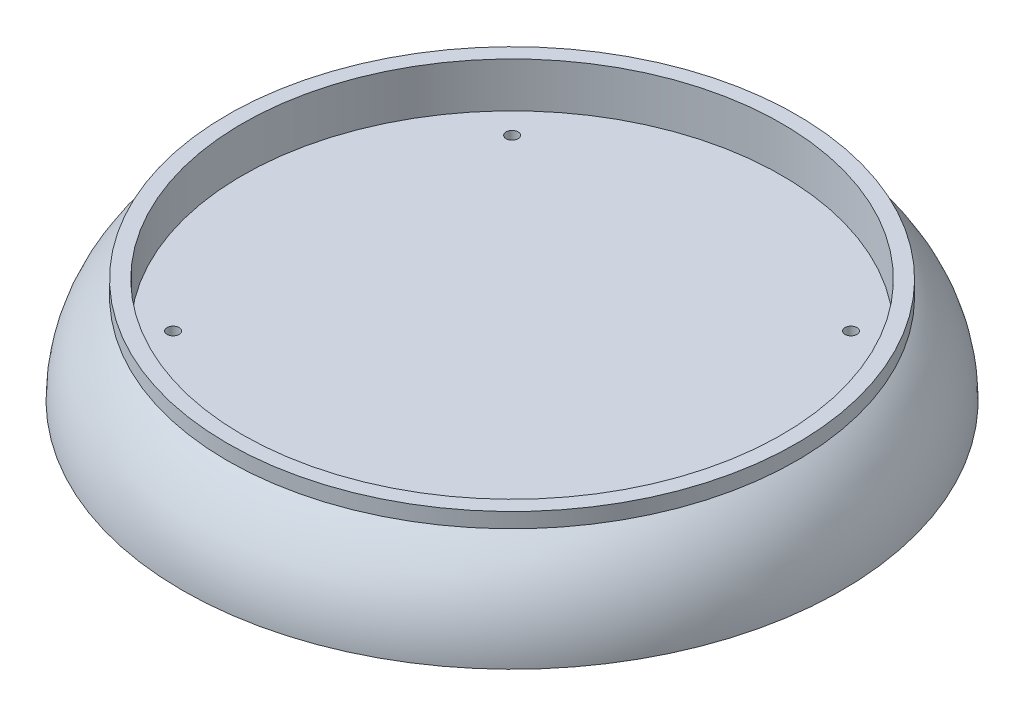
ISO-10303-21;
HEADER;
FILE_DESCRIPTION(('STEP AP214'),'2;1');
FILE_NAME('part.step','',(''),(''),'','','');
FILE_SCHEMA(('AUTOMOTIVE_DESIGN { 1 0 10303 214 1 1 1 1 }'));
ENDSEC;
DATA;
#1=APPLICATION_CONTEXT('core data for automotive mechanical design processes');
#2=APPLICATION_PROTOCOL_DEFINITION('international standard','automotive_design',2000,#1);
#3=PRODUCT_CONTEXT('',#1,'mechanical');
#4=PRODUCT('Part','Part','',(#3));
#5=PRODUCT_RELATED_PRODUCT_CATEGORY('part','',(#4));
#6=PRODUCT_DEFINITION_FORMATION('','',#4);
#7=PRODUCT_DEFINITION_CONTEXT('part definition',#1,'design');
#8=PRODUCT_DEFINITION('design','',#6,#7);
#9=PRODUCT_DEFINITION_SHAPE('','',#8);
#10=(LENGTH_UNIT() NAMED_UNIT(*) SI_UNIT(.MILLI.,.METRE.));
#11=(NAMED_UNIT(*) PLANE_ANGLE_UNIT() SI_UNIT($,.RADIAN.));
#12=(NAMED_UNIT(*) SI_UNIT($,.STERADIAN.) SOLID_ANGLE_UNIT());
#13=UNCERTAINTY_MEASURE_WITH_UNIT(LENGTH_MEASURE(1.E-05),#10,'distance_accuracy_value','');
#14=(GEOMETRIC_REPRESENTATION_CONTEXT(3) GLOBAL_UNCERTAINTY_ASSIGNED_CONTEXT((#13)) GLOBAL_UNIT_ASSIGNED_CONTEXT((#10,
#11,#12)) REPRESENTATION_CONTEXT('',''));
#15=CARTESIAN_POINT('',(0.,0.,0.));
#16=DIRECTION('',(0.,0.,1.));
#17=DIRECTION('',(1.,0.,0.));
#18=AXIS2_PLACEMENT_3D('',#15,#16,#17);
#19=CARTESIAN_POINT('',(0.,0.,0.));
#20=DIRECTION('',(0.,-1.,0.));
#21=DIRECTION('',(0.,0.,-1.));
#22=AXIS2_PLACEMENT_3D('',#19,#20,#21);
#23=PLANE('',#22);
#24=CARTESIAN_POINT('',(56.5685424949238,0.,56.5685424949238));
#25=DIRECTION('',(0.,1.,0.));
#26=DIRECTION('',(0.,0.,1.));
#27=AXIS2_PLACEMENT_3D('',#24,#25,#26);
#28=CIRCLE('',#27,2.);
#29=CARTESIAN_POINT('',(56.5685424949238,0.,58.5685424949238));
#30=VERTEX_POINT('',#29);
#31=EDGE_CURVE('E71',#30,#30,#28,.T.);
#32=ORIENTED_EDGE('',*,*,#31,.F.);
#33=EDGE_LOOP('',(#32));
#34=FACE_BOUND('',#33,.T.);
#35=CARTESIAN_POINT('',(56.5685424949238,0.,-56.5685424949238));
#36=DIRECTION('',(0.,1.,0.));
#37=DIRECTION('',(0.,0.,-1.));
#38=AXIS2_PLACEMENT_3D('',#35,#36,#37);
#39=CIRCLE('',#38,2.);
#40=CARTESIAN_POINT('',(56.5685424949238,0.,-58.5685424949238));
#41=VERTEX_POINT('',#40);
#42=EDGE_CURVE('E65',#41,#41,#39,.T.);
#43=ORIENTED_EDGE('',*,*,#42,.F.);
#44=EDGE_LOOP('',(#43));
#45=FACE_BOUND('',#44,.T.);
#46=CARTESIAN_POINT('',(-56.5685424949238,0.,56.5685424949238));
#47=DIRECTION('',(0.,1.,0.));
#48=DIRECTION('',(0.,0.,-1.));
#49=AXIS2_PLACEMENT_3D('',#46,#47,#48);
#50=CIRCLE('',#49,2.);
#51=CARTESIAN_POINT('',(-56.5685424949238,0.,54.5685424949238));
#52=VERTEX_POINT('',#51);
#53=EDGE_CURVE('E59',#52,#52,#50,.T.);
#54=ORIENTED_EDGE('',*,*,#53,.F.);
#55=EDGE_LOOP('',(#54));
#56=FACE_BOUND('',#55,.T.);
#57=CARTESIAN_POINT('',(-56.5685424949238,0.,-56.5685424949238));
#58=DIRECTION('',(0.,1.,0.));
#59=DIRECTION('',(0.,0.,1.));
#60=AXIS2_PLACEMENT_3D('',#57,#58,#59);
#61=CIRCLE('',#60,2.);
#62=CARTESIAN_POINT('',(-56.5685424949238,0.,-54.5685424949238));
#63=VERTEX_POINT('',#62);
#64=EDGE_CURVE('E53',#63,#63,#61,.T.);
#65=ORIENTED_EDGE('',*,*,#64,.F.);
#66=EDGE_LOOP('',(#65));
#67=FACE_BOUND('',#66,.T.);
#68=CARTESIAN_POINT('',(0.,0.,0.));
#69=DIRECTION('',(0.,1.,0.));
#70=DIRECTION('',(0.,0.,1.));
#71=AXIS2_PLACEMENT_3D('',#68,#69,#70);
#72=CIRCLE('',#71,90.);
#73=CARTESIAN_POINT('',(0.,0.,90.));
#74=VERTEX_POINT('',#73);
#75=EDGE_CURVE('E49',#74,#74,#72,.T.);
#76=ORIENTED_EDGE('',*,*,#75,.T.);
#77=EDGE_LOOP('',(#76));
#78=FACE_BOUND('',#77,.T.);
#79=ADVANCED_FACE('F30',(#34,#45,#56,#67,#78),#23,.F.);
#80=CARTESIAN_POINT('',(0.,-20.,0.));
#81=DIRECTION('',(0.,1.,0.));
#82=DIRECTION('',(0.,0.,1.));
#83=AXIS2_PLACEMENT_3D('',#80,#81,#82);
#84=PLANE('',#83);
#85=CARTESIAN_POINT('',(56.5685424949238,-20.,56.5685424949238));
#86=DIRECTION('',(0.,1.,0.));
#87=DIRECTION('',(0.,0.,1.));
#88=AXIS2_PLACEMENT_3D('',#85,#86,#87);
#89=CIRCLE('',#88,2.);
#90=CARTESIAN_POINT('',(56.5685424949238,-20.,58.5685424949238));
#91=VERTEX_POINT('',#90);
#92=EDGE_CURVE('E68',#91,#91,#89,.T.);
#93=ORIENTED_EDGE('',*,*,#92,.T.);
#94=EDGE_LOOP('',(#93));
#95=FACE_BOUND('',#94,.T.);
#96=CARTESIAN_POINT('',(56.5685424949238,-20.,-56.5685424949238));
#97=DIRECTION('',(0.,1.,0.));
#98=DIRECTION('',(0.,0.,-1.));
#99=AXIS2_PLACEMENT_3D('',#96,#97,#98);
#100=CIRCLE('',#99,2.);
#101=CARTESIAN_POINT('',(56.5685424949238,-20.,-58.5685424949238));
#102=VERTEX_POINT('',#101);
#103=EDGE_CURVE('E62',#102,#102,#100,.T.);
#104=ORIENTED_EDGE('',*,*,#103,.T.);
#105=EDGE_LOOP('',(#104));
#106=FACE_BOUND('',#105,.T.);
#107=CARTESIAN_POINT('',(-56.5685424949238,-20.,56.5685424949238));
#108=DIRECTION('',(0.,1.,0.));
#109=DIRECTION('',(0.,0.,-1.));
#110=AXIS2_PLACEMENT_3D('',#107,#108,#109);
#111=CIRCLE('',#110,2.);
#112=CARTESIAN_POINT('',(-56.5685424949238,-20.,54.5685424949238));
#113=VERTEX_POINT('',#112);
#114=EDGE_CURVE('E56',#113,#113,#111,.T.);
#115=ORIENTED_EDGE('',*,*,#114,.T.);
#116=EDGE_LOOP('',(#115));
#117=FACE_BOUND('',#116,.T.);
#118=CARTESIAN_POINT('',(-56.5685424949238,-20.,-56.5685424949238));
#119=DIRECTION('',(0.,1.,0.));
#120=DIRECTION('',(0.,0.,1.));
#121=AXIS2_PLACEMENT_3D('',#118,#119,#120);
#122=CIRCLE('',#121,2.);
#123=CARTESIAN_POINT('',(-56.5685424949238,-20.,-54.5685424949238));
#124=VERTEX_POINT('',#123);
#125=EDGE_CURVE('E52',#124,#124,#122,.T.);
#126=ORIENTED_EDGE('',*,*,#125,.T.);
#127=EDGE_LOOP('',(#126));
#128=FACE_BOUND('',#127,.T.);
#129=CARTESIAN_POINT('',(0.,-20.,0.));
#130=DIRECTION('',(0.,1.,0.));
#131=DIRECTION('',(0.,0.,1.));
#132=AXIS2_PLACEMENT_3D('',#129,#130,#131);
#133=CIRCLE('',#132,110.);
#134=CARTESIAN_POINT('',(0.,-20.,110.));
#135=VERTEX_POINT('',#134);
#136=EDGE_CURVE('E10',#135,#135,#133,.T.);
#137=ORIENTED_EDGE('',*,*,#136,.F.);
#138=EDGE_LOOP('',(#137));
#139=FACE_BOUND('',#138,.T.);
#140=ADVANCED_FACE('F77',(#95,#106,#117,#128,#139),#84,.F.);
#141=CARTESIAN_POINT('',(0.,-20.,0.));
#142=DIRECTION('',(0.,1.,0.));
#143=DIRECTION('',(0.,0.,1.));
#144=AXIS2_PLACEMENT_3D('',#141,#142,#143);
#145=TOROIDAL_SURFACE('',#144,72.5,37.5);
#146=CARTESIAN_POINT('',(0.,10.,0.));
#147=DIRECTION('',(0.,1.,0.));
#148=DIRECTION('',(0.,0.,1.));
#149=AXIS2_PLACEMENT_3D('',#146,#147,#148);
#150=CIRCLE('',#149,95.);
#151=CARTESIAN_POINT('',(0.,10.,95.));
#152=VERTEX_POINT('',#151);
#153=EDGE_CURVE('E36',#152,#152,#150,.T.);
#154=ORIENTED_EDGE('',*,*,#153,.F.);
#155=EDGE_LOOP('',(#154));
#156=FACE_BOUND('',#155,.T.);
#157=ORIENTED_EDGE('',*,*,#136,.T.);
#158=EDGE_LOOP('',(#157));
#159=FACE_BOUND('',#158,.T.);
#160=ADVANCED_FACE('F112',(#156,#159),#145,.T.);
#161=CARTESIAN_POINT('',(0.,0.,0.));
#162=DIRECTION('',(0.,1.,0.));
#163=DIRECTION('',(0.,0.,1.));
#164=AXIS2_PLACEMENT_3D('',#161,#162,#163);
#165=CYLINDRICAL_SURFACE('',#164,95.);
#166=CARTESIAN_POINT('',(0.,15.,0.));
#167=DIRECTION('',(0.,1.,0.));
#168=DIRECTION('',(0.,0.,1.));
#169=AXIS2_PLACEMENT_3D('',#166,#167,#168);
#170=CIRCLE('',#169,95.);
#171=CARTESIAN_POINT('',(0.,15.,95.));
#172=VERTEX_POINT('',#171);
#173=EDGE_CURVE('E40',#172,#172,#170,.T.);
#174=ORIENTED_EDGE('',*,*,#173,.F.);
#175=EDGE_LOOP('',(#174));
#176=FACE_BOUND('',#175,.T.);
#177=ORIENTED_EDGE('',*,*,#153,.T.);
#178=EDGE_LOOP('',(#177));
#179=FACE_BOUND('',#178,.T.);
#180=ADVANCED_FACE('F107',(#176,#179),#165,.T.);
#181=CARTESIAN_POINT('',(90.,15.,0.));
#182=DIRECTION('',(0.,-1.,0.));
#183=DIRECTION('',(0.,0.,-1.));
#184=AXIS2_PLACEMENT_3D('',#181,#182,#183);
#185=PLANE('',#184);
#186=CARTESIAN_POINT('',(0.,15.,0.));
#187=DIRECTION('',(0.,1.,0.));
#188=DIRECTION('',(0.,0.,1.));
#189=AXIS2_PLACEMENT_3D('',#186,#187,#188);
#190=CIRCLE('',#189,90.);
#191=CARTESIAN_POINT('',(0.,15.,90.));
#192=VERTEX_POINT('',#191);
#193=EDGE_CURVE('E44',#192,#192,#190,.T.);
#194=ORIENTED_EDGE('',*,*,#193,.F.);
#195=EDGE_LOOP('',(#194));
#196=FACE_BOUND('',#195,.T.);
#197=ORIENTED_EDGE('',*,*,#173,.T.);
#198=EDGE_LOOP('',(#197));
#199=FACE_BOUND('',#198,.T.);
#200=ADVANCED_FACE('F101',(#196,#199),#185,.F.);
#201=CARTESIAN_POINT('',(0.,0.,0.));
#202=DIRECTION('',(0.,1.,0.));
#203=DIRECTION('',(0.,0.,1.));
#204=AXIS2_PLACEMENT_3D('',#201,#202,#203);
#205=CYLINDRICAL_SURFACE('',#204,90.);
#206=ORIENTED_EDGE('',*,*,#75,.F.);
#207=EDGE_LOOP('',(#206));
#208=FACE_BOUND('',#207,.T.);
#209=ORIENTED_EDGE('',*,*,#193,.T.);
#210=EDGE_LOOP('',(#209));
#211=FACE_BOUND('',#210,.T.);
#212=ADVANCED_FACE('F97',(#208,#211),#205,.F.);
#213=CARTESIAN_POINT('',(-56.5685424949238,-20.,-56.5685424949238));
#214=DIRECTION('',(0.,1.,0.));
#215=DIRECTION('',(0.,0.,1.));
#216=AXIS2_PLACEMENT_3D('',#213,#214,#215);
#217=CYLINDRICAL_SURFACE('',#216,2.);
#218=ORIENTED_EDGE('',*,*,#125,.F.);
#219=EDGE_LOOP('',(#218));
#220=FACE_BOUND('',#219,.T.);
#221=ORIENTED_EDGE('',*,*,#64,.T.);
#222=EDGE_LOOP('',(#221));
#223=FACE_BOUND('',#222,.T.);
#224=ADVANCED_FACE('F100',(#220,#223),#217,.F.);
#225=CARTESIAN_POINT('',(-56.5685424949238,-20.,56.5685424949238));
#226=DIRECTION('',(0.,1.,0.));
#227=DIRECTION('',(0.,0.,1.));
#228=AXIS2_PLACEMENT_3D('',#225,#226,#227);
#229=CYLINDRICAL_SURFACE('',#228,2.);
#230=ORIENTED_EDGE('',*,*,#114,.F.);
#231=EDGE_LOOP('',(#230));
#232=FACE_BOUND('',#231,.T.);
#233=ORIENTED_EDGE('',*,*,#53,.T.);
#234=EDGE_LOOP('',(#233));
#235=FACE_BOUND('',#234,.T.);
#236=ADVANCED_FACE('F159',(#232,#235),#229,.F.);
#237=CARTESIAN_POINT('',(56.5685424949238,-20.,-56.5685424949238));
#238=DIRECTION('',(0.,1.,0.));
#239=DIRECTION('',(0.,0.,1.));
#240=AXIS2_PLACEMENT_3D('',#237,#238,#239);
#241=CYLINDRICAL_SURFACE('',#240,2.);
#242=ORIENTED_EDGE('',*,*,#103,.F.);
#243=EDGE_LOOP('',(#242));
#244=FACE_BOUND('',#243,.T.);
#245=ORIENTED_EDGE('',*,*,#42,.T.);
#246=EDGE_LOOP('',(#245));
#247=FACE_BOUND('',#246,.T.);
#248=ADVANCED_FACE('F83',(#244,#247),#241,.F.);
#249=CARTESIAN_POINT('',(56.5685424949238,-20.,56.5685424949238));
#250=DIRECTION('',(0.,1.,0.));
#251=DIRECTION('',(0.,0.,1.));
#252=AXIS2_PLACEMENT_3D('',#249,#250,#251);
#253=CYLINDRICAL_SURFACE('',#252,2.);
#254=ORIENTED_EDGE('',*,*,#92,.F.);
#255=EDGE_LOOP('',(#254));
#256=FACE_BOUND('',#255,.T.);
#257=ORIENTED_EDGE('',*,*,#31,.T.);
#258=EDGE_LOOP('',(#257));
#259=FACE_BOUND('',#258,.T.);
#260=ADVANCED_FACE('F80',(#256,#259),#253,.F.);
#261=CLOSED_SHELL('',(#79,#140,#160,#180,#200,#212,#224,#236,#248,#260));
#262=MANIFOLD_SOLID_BREP('B2',#261);
#263=ADVANCED_BREP_SHAPE_REPRESENTATION('',(#18,#262),#14);
#264=SHAPE_DEFINITION_REPRESENTATION(#9,#263);
ENDSEC;
END-ISO-10303-21;
